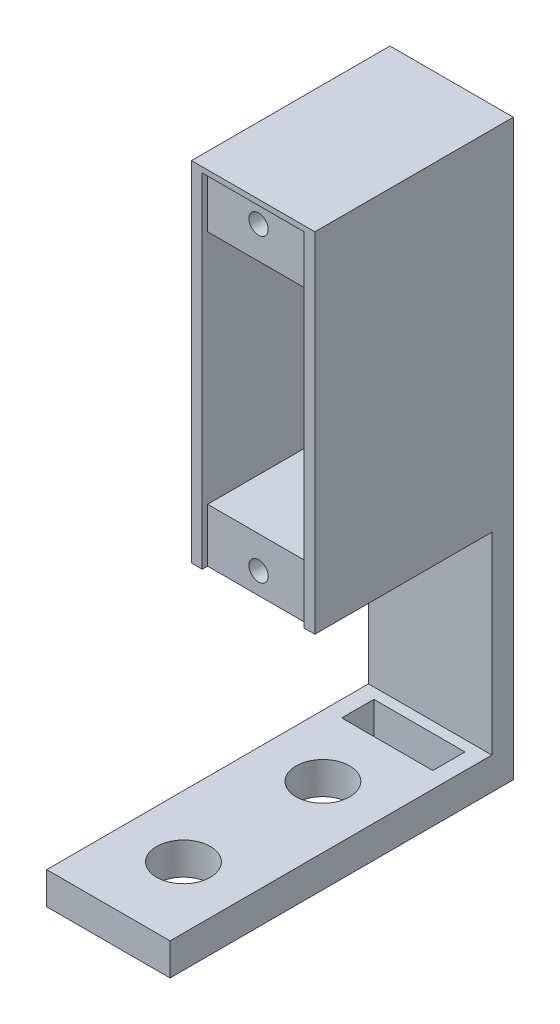
ISO-10303-21;
HEADER;
FILE_DESCRIPTION(('STEP AP214'),'2;1');
FILE_NAME('part.step','',(''),(''),'','','');
FILE_SCHEMA(('AUTOMOTIVE_DESIGN { 1 0 10303 214 1 1 1 1 }'));
ENDSEC;
DATA;
#1=APPLICATION_CONTEXT('core data for automotive mechanical design processes');
#2=APPLICATION_PROTOCOL_DEFINITION('international standard','automotive_design',2000,#1);
#3=PRODUCT_CONTEXT('',#1,'mechanical');
#4=PRODUCT('Part','Part','',(#3));
#5=PRODUCT_RELATED_PRODUCT_CATEGORY('part','',(#4));
#6=PRODUCT_DEFINITION_FORMATION('','',#4);
#7=PRODUCT_DEFINITION_CONTEXT('part definition',#1,'design');
#8=PRODUCT_DEFINITION('design','',#6,#7);
#9=PRODUCT_DEFINITION_SHAPE('','',#8);
#10=(LENGTH_UNIT() NAMED_UNIT(*) SI_UNIT(.MILLI.,.METRE.));
#11=(NAMED_UNIT(*) PLANE_ANGLE_UNIT() SI_UNIT($,.RADIAN.));
#12=(NAMED_UNIT(*) SI_UNIT($,.STERADIAN.) SOLID_ANGLE_UNIT());
#13=UNCERTAINTY_MEASURE_WITH_UNIT(LENGTH_MEASURE(1.E-05),#10,'distance_accuracy_value','');
#14=(GEOMETRIC_REPRESENTATION_CONTEXT(3) GLOBAL_UNCERTAINTY_ASSIGNED_CONTEXT((#13)) GLOBAL_UNIT_ASSIGNED_CONTEXT((#10,
#11,#12)) REPRESENTATION_CONTEXT('',''));
#15=CARTESIAN_POINT('',(0.,0.,0.));
#16=DIRECTION('',(0.,0.,1.));
#17=DIRECTION('',(1.,0.,0.));
#18=AXIS2_PLACEMENT_3D('',#15,#16,#17);
#19=CARTESIAN_POINT('',(0.,0.,2.));
#20=DIRECTION('',(0.,0.,1.));
#21=DIRECTION('',(1.,0.,0.));
#22=AXIS2_PLACEMENT_3D('',#19,#20,#21);
#23=PLANE('',#22);
#24=DIRECTION('',(0.,1.,0.));
#25=VECTOR('',#24,1.);
#26=CARTESIAN_POINT('',(-11.5,-21.,2.));
#27=LINE('',#26,#25);
#28=CARTESIAN_POINT('',(-11.5,-18.,2.));
#29=VERTEX_POINT('',#28);
#30=CARTESIAN_POINT('',(-11.5,0.,2.));
#31=VERTEX_POINT('',#30);
#32=EDGE_CURVE('E317',#29,#31,#27,.T.);
#33=ORIENTED_EDGE('',*,*,#32,.F.);
#34=DIRECTION('',(-1.,0.,0.));
#35=VECTOR('',#34,1.);
#36=CARTESIAN_POINT('',(0.,-18.,2.));
#37=LINE('',#36,#35);
#38=CARTESIAN_POINT('',(0.,-18.,2.));
#39=VERTEX_POINT('',#38);
#40=EDGE_CURVE('E238',#39,#29,#37,.T.);
#41=ORIENTED_EDGE('',*,*,#40,.F.);
#42=DIRECTION('',(0.,1.,0.));
#43=VECTOR('',#42,1.);
#44=CARTESIAN_POINT('',(0.,-21.,2.));
#45=LINE('',#44,#43);
#46=CARTESIAN_POINT('',(0.,0.,2.));
#47=VERTEX_POINT('',#46);
#48=EDGE_CURVE('E326',#39,#47,#45,.T.);
#49=ORIENTED_EDGE('',*,*,#48,.T.);
#50=DIRECTION('',(-1.,0.,0.));
#51=VECTOR('',#50,1.);
#52=CARTESIAN_POINT('',(0.,0.,2.));
#53=LINE('',#52,#51);
#54=CARTESIAN_POINT('',(-0.999999999999996,0.,2.));
#55=VERTEX_POINT('',#54);
#56=EDGE_CURVE('E318',#47,#55,#53,.T.);
#57=ORIENTED_EDGE('',*,*,#56,.T.);
#58=DIRECTION('',(0.,1.,0.));
#59=VECTOR('',#58,1.);
#60=CARTESIAN_POINT('',(-1.,32.,2.));
#61=LINE('',#60,#59);
#62=CARTESIAN_POINT('',(-0.999999999999997,27.,2.));
#63=VERTEX_POINT('',#62);
#64=EDGE_CURVE('E365',#55,#63,#61,.T.);
#65=ORIENTED_EDGE('',*,*,#64,.T.);
#66=DIRECTION('',(1.,0.,0.));
#67=VECTOR('',#66,1.);
#68=CARTESIAN_POINT('',(-10.5,27.,2.));
#69=LINE('',#68,#67);
#70=CARTESIAN_POINT('',(-10.5,27.,2.));
#71=VERTEX_POINT('',#70);
#72=EDGE_CURVE('E334',#71,#63,#69,.T.);
#73=ORIENTED_EDGE('',*,*,#72,.F.);
#74=DIRECTION('',(0.,-1.,0.));
#75=VECTOR('',#74,1.);
#76=CARTESIAN_POINT('',(-10.5,32.,2.));
#77=LINE('',#76,#75);
#78=CARTESIAN_POINT('',(-10.5,0.,2.));
#79=VERTEX_POINT('',#78);
#80=EDGE_CURVE('E362',#71,#79,#77,.T.);
#81=ORIENTED_EDGE('',*,*,#80,.T.);
#82=EDGE_CURVE('E323',#79,#31,#53,.T.);
#83=ORIENTED_EDGE('',*,*,#82,.T.);
#84=EDGE_LOOP('',(#33,#41,#49,#57,#65,#73,#81,#83));
#85=FACE_BOUND('',#84,.T.);
#86=ADVANCED_FACE('F39',(#85),#23,.T.);
#87=CARTESIAN_POINT('',(-10.5,32.,2.));
#88=DIRECTION('',(-1.,0.,0.));
#89=DIRECTION('',(0.,-1.,0.));
#90=AXIS2_PLACEMENT_3D('',#87,#88,#89);
#91=PLANE('',#90);
#92=DIRECTION('',(0.,0.,-1.));
#93=VECTOR('',#92,1.);
#94=CARTESIAN_POINT('',(-10.5,5.,18.));
#95=LINE('',#94,#93);
#96=CARTESIAN_POINT('',(-10.5,5.,18.));
#97=VERTEX_POINT('',#96);
#98=CARTESIAN_POINT('',(-10.5,5.,9.));
#99=VERTEX_POINT('',#98);
#100=EDGE_CURVE('E298',#97,#99,#95,.T.);
#101=ORIENTED_EDGE('',*,*,#100,.T.);
#102=DIRECTION('',(0.,-1.,0.));
#103=VECTOR('',#102,1.);
#104=CARTESIAN_POINT('',(-10.5,7.,9.));
#105=LINE('',#104,#103);
#106=CARTESIAN_POINT('',(-10.5,0.,9.));
#107=VERTEX_POINT('',#106);
#108=EDGE_CURVE('E272',#99,#107,#105,.T.);
#109=ORIENTED_EDGE('',*,*,#108,.T.);
#110=DIRECTION('',(0.,0.,-1.));
#111=VECTOR('',#110,1.);
#112=CARTESIAN_POINT('',(-10.5,0.,9.));
#113=LINE('',#112,#111);
#114=EDGE_CURVE('E259',#107,#79,#113,.T.);
#115=ORIENTED_EDGE('',*,*,#114,.T.);
#116=ORIENTED_EDGE('',*,*,#80,.F.);
#117=DIRECTION('',(0.,0.,-1.));
#118=VECTOR('',#117,1.);
#119=CARTESIAN_POINT('',(-10.5,27.,18.));
#120=LINE('',#119,#118);
#121=CARTESIAN_POINT('',(-10.5,27.,18.));
#122=VERTEX_POINT('',#121);
#123=EDGE_CURVE('E358',#122,#71,#120,.T.);
#124=ORIENTED_EDGE('',*,*,#123,.F.);
#125=DIRECTION('',(0.,-1.,0.));
#126=VECTOR('',#125,1.);
#127=CARTESIAN_POINT('',(-10.5,32.,18.));
#128=LINE('',#127,#126);
#129=CARTESIAN_POINT('',(-10.5,32.,18.));
#130=VERTEX_POINT('',#129);
#131=EDGE_CURVE('E338',#130,#122,#128,.T.);
#132=ORIENTED_EDGE('',*,*,#131,.F.);
#133=DIRECTION('',(0.,0.,1.));
#134=VECTOR('',#133,1.);
#135=CARTESIAN_POINT('',(-10.5,32.,2.));
#136=LINE('',#135,#134);
#137=CARTESIAN_POINT('',(-10.5,32.,18.5));
#138=VERTEX_POINT('',#137);
#139=EDGE_CURVE('E380',#130,#138,#136,.T.);
#140=ORIENTED_EDGE('',*,*,#139,.T.);
#141=DIRECTION('',(0.,-1.,0.));
#142=VECTOR('',#141,1.);
#143=CARTESIAN_POINT('',(-10.5,32.,18.5));
#144=LINE('',#143,#142);
#145=CARTESIAN_POINT('',(-10.5,0.,18.5));
#146=VERTEX_POINT('',#145);
#147=EDGE_CURVE('E361',#138,#146,#144,.T.);
#148=ORIENTED_EDGE('',*,*,#147,.T.);
#149=DIRECTION('',(0.,0.,1.));
#150=VECTOR('',#149,1.);
#151=CARTESIAN_POINT('',(-10.5,0.,2.));
#152=LINE('',#151,#150);
#153=CARTESIAN_POINT('',(-10.5,0.,18.));
#154=VERTEX_POINT('',#153);
#155=EDGE_CURVE('E369',#154,#146,#152,.T.);
#156=ORIENTED_EDGE('',*,*,#155,.F.);
#157=DIRECTION('',(0.,-1.,0.));
#158=VECTOR('',#157,1.);
#159=CARTESIAN_POINT('',(-10.5,0.,18.));
#160=LINE('',#159,#158);
#161=EDGE_CURVE('E292',#97,#154,#160,.T.);
#162=ORIENTED_EDGE('',*,*,#161,.F.);
#163=EDGE_LOOP('',(#101,#109,#115,#116,#124,#132,#140,#148,#156,#162));
#164=FACE_BOUND('',#163,.T.);
#165=ADVANCED_FACE('F467',(#164),#91,.F.);
#166=CARTESIAN_POINT('',(-1.,32.,2.));
#167=DIRECTION('',(1.,0.,0.));
#168=DIRECTION('',(0.,1.,0.));
#169=AXIS2_PLACEMENT_3D('',#166,#167,#168);
#170=PLANE('',#169);
#171=DIRECTION('',(0.,-1.,0.));
#172=VECTOR('',#171,1.);
#173=CARTESIAN_POINT('',(-0.999999999999998,7.,9.));
#174=LINE('',#173,#172);
#175=CARTESIAN_POINT('',(-0.999999999999998,5.,9.));
#176=VERTEX_POINT('',#175);
#177=CARTESIAN_POINT('',(-0.999999999999997,0.,9.));
#178=VERTEX_POINT('',#177);
#179=EDGE_CURVE('E271',#176,#178,#174,.T.);
#180=ORIENTED_EDGE('',*,*,#179,.F.);
#181=DIRECTION('',(0.,0.,-1.));
#182=VECTOR('',#181,1.);
#183=CARTESIAN_POINT('',(-0.999999999999997,5.,18.));
#184=LINE('',#183,#182);
#185=CARTESIAN_POINT('',(-0.999999999999997,5.,18.));
#186=VERTEX_POINT('',#185);
#187=EDGE_CURVE('E302',#186,#176,#184,.T.);
#188=ORIENTED_EDGE('',*,*,#187,.F.);
#189=DIRECTION('',(0.,1.,0.));
#190=VECTOR('',#189,1.);
#191=CARTESIAN_POINT('',(-0.999999999999997,0.,18.));
#192=LINE('',#191,#190);
#193=CARTESIAN_POINT('',(-0.999999999999997,0.,18.));
#194=VERTEX_POINT('',#193);
#195=EDGE_CURVE('E282',#194,#186,#192,.T.);
#196=ORIENTED_EDGE('',*,*,#195,.F.);
#197=DIRECTION('',(0.,0.,1.));
#198=VECTOR('',#197,1.);
#199=CARTESIAN_POINT('',(-0.999999999999997,0.,2.));
#200=LINE('',#199,#198);
#201=CARTESIAN_POINT('',(-0.999999999999997,0.,18.5));
#202=VERTEX_POINT('',#201);
#203=EDGE_CURVE('E387',#194,#202,#200,.T.);
#204=ORIENTED_EDGE('',*,*,#203,.T.);
#205=DIRECTION('',(0.,1.,0.));
#206=VECTOR('',#205,1.);
#207=CARTESIAN_POINT('',(-1.,32.,18.5));
#208=LINE('',#207,#206);
#209=CARTESIAN_POINT('',(-1.,32.,18.5));
#210=VERTEX_POINT('',#209);
#211=EDGE_CURVE('E373',#202,#210,#208,.T.);
#212=ORIENTED_EDGE('',*,*,#211,.T.);
#213=DIRECTION('',(0.,0.,1.));
#214=VECTOR('',#213,1.);
#215=CARTESIAN_POINT('',(-1.,32.,2.));
#216=LINE('',#215,#214);
#217=CARTESIAN_POINT('',(-1.,32.,18.));
#218=VERTEX_POINT('',#217);
#219=EDGE_CURVE('E384',#218,#210,#216,.T.);
#220=ORIENTED_EDGE('',*,*,#219,.F.);
#221=DIRECTION('',(0.,1.,0.));
#222=VECTOR('',#221,1.);
#223=CARTESIAN_POINT('',(-1.,32.,18.));
#224=LINE('',#223,#222);
#225=CARTESIAN_POINT('',(-0.999999999999997,27.,18.));
#226=VERTEX_POINT('',#225);
#227=EDGE_CURVE('E345',#226,#218,#224,.T.);
#228=ORIENTED_EDGE('',*,*,#227,.F.);
#229=DIRECTION('',(0.,0.,-1.));
#230=VECTOR('',#229,1.);
#231=CARTESIAN_POINT('',(-0.999999999999997,27.,18.));
#232=LINE('',#231,#230);
#233=EDGE_CURVE('E351',#226,#63,#232,.T.);
#234=ORIENTED_EDGE('',*,*,#233,.T.);
#235=ORIENTED_EDGE('',*,*,#64,.F.);
#236=DIRECTION('',(0.,0.,1.));
#237=VECTOR('',#236,1.);
#238=CARTESIAN_POINT('',(-0.999999999999997,0.,9.));
#239=LINE('',#238,#237);
#240=EDGE_CURVE('E263',#55,#178,#239,.T.);
#241=ORIENTED_EDGE('',*,*,#240,.T.);
#242=EDGE_LOOP('',(#180,#188,#196,#204,#212,#220,#228,#234,#235,#241));
#243=FACE_BOUND('',#242,.T.);
#244=ADVANCED_FACE('F473',(#243),#170,.F.);
#245=CARTESIAN_POINT('',(0.,0.,18.5));
#246=DIRECTION('',(0.,1.,0.));
#247=DIRECTION('',(-1.,0.,0.));
#248=AXIS2_PLACEMENT_3D('',#245,#246,#247);
#249=PLANE('',#248);
#250=ORIENTED_EDGE('',*,*,#82,.F.);
#251=ORIENTED_EDGE('',*,*,#114,.F.);
#252=DIRECTION('',(-1.,0.,0.));
#253=VECTOR('',#252,1.);
#254=CARTESIAN_POINT('',(-10.5,0.,9.));
#255=LINE('',#254,#253);
#256=EDGE_CURVE('E267',#178,#107,#255,.T.);
#257=ORIENTED_EDGE('',*,*,#256,.F.);
#258=ORIENTED_EDGE('',*,*,#240,.F.);
#259=ORIENTED_EDGE('',*,*,#56,.F.);
#260=DIRECTION('',(0.,0.,-1.));
#261=VECTOR('',#260,1.);
#262=CARTESIAN_POINT('',(0.,0.,18.5));
#263=LINE('',#262,#261);
#264=CARTESIAN_POINT('',(0.,0.,18.5));
#265=VERTEX_POINT('',#264);
#266=EDGE_CURVE('E408',#265,#47,#263,.T.);
#267=ORIENTED_EDGE('',*,*,#266,.F.);
#268=DIRECTION('',(1.,0.,0.));
#269=VECTOR('',#268,1.);
#270=CARTESIAN_POINT('',(0.,0.,18.5));
#271=LINE('',#270,#269);
#272=EDGE_CURVE('E403',#202,#265,#271,.T.);
#273=ORIENTED_EDGE('',*,*,#272,.F.);
#274=ORIENTED_EDGE('',*,*,#203,.F.);
#275=DIRECTION('',(1.,0.,0.));
#276=VECTOR('',#275,1.);
#277=CARTESIAN_POINT('',(-0.999999999999997,0.,18.));
#278=LINE('',#277,#276);
#279=EDGE_CURVE('E295',#154,#194,#278,.T.);
#280=ORIENTED_EDGE('',*,*,#279,.F.);
#281=ORIENTED_EDGE('',*,*,#155,.T.);
#282=CARTESIAN_POINT('',(-11.5,0.,18.5));
#283=VERTEX_POINT('',#282);
#284=EDGE_CURVE('E404',#283,#146,#271,.T.);
#285=ORIENTED_EDGE('',*,*,#284,.F.);
#286=DIRECTION('',(0.,0.,-1.));
#287=VECTOR('',#286,1.);
#288=CARTESIAN_POINT('',(-11.5,0.,18.5));
#289=LINE('',#288,#287);
#290=EDGE_CURVE('E420',#283,#31,#289,.T.);
#291=ORIENTED_EDGE('',*,*,#290,.T.);
#292=EDGE_LOOP('',(#250,#251,#257,#258,#259,#267,#273,#274,#280,#281,#285,#291));
#293=FACE_BOUND('',#292,.T.);
#294=ADVANCED_FACE('F487',(#293),#249,.F.);
#295=CARTESIAN_POINT('',(0.,0.,18.5));
#296=DIRECTION('',(-1.,0.,0.));
#297=DIRECTION('',(0.,-1.,0.));
#298=AXIS2_PLACEMENT_3D('',#295,#296,#297);
#299=PLANE('',#298);
#300=DIRECTION('',(0.,1.,0.));
#301=VECTOR('',#300,1.);
#302=CARTESIAN_POINT('',(0.,0.,0.));
#303=LINE('',#302,#301);
#304=CARTESIAN_POINT('',(0.,-21.,0.));
#305=VERTEX_POINT('',#304);
#306=CARTESIAN_POINT('',(0.,32.5,0.));
#307=VERTEX_POINT('',#306);
#308=EDGE_CURVE('E383',#305,#307,#303,.T.);
#309=ORIENTED_EDGE('',*,*,#308,.T.);
#310=DIRECTION('',(0.,0.,-1.));
#311=VECTOR('',#310,1.);
#312=CARTESIAN_POINT('',(0.,32.5,18.5));
#313=LINE('',#312,#311);
#314=CARTESIAN_POINT('',(0.,32.5,18.5));
#315=VERTEX_POINT('',#314);
#316=EDGE_CURVE('E428',#315,#307,#313,.T.);
#317=ORIENTED_EDGE('',*,*,#316,.F.);
#318=DIRECTION('',(0.,1.,0.));
#319=VECTOR('',#318,1.);
#320=CARTESIAN_POINT('',(0.,0.,18.5));
#321=LINE('',#320,#319);
#322=EDGE_CURVE('E392',#265,#315,#321,.T.);
#323=ORIENTED_EDGE('',*,*,#322,.F.);
#324=ORIENTED_EDGE('',*,*,#266,.T.);
#325=ORIENTED_EDGE('',*,*,#48,.F.);
#326=DIRECTION('',(0.,0.,-1.));
#327=VECTOR('',#326,1.);
#328=CARTESIAN_POINT('',(0.,-18.,32.));
#329=LINE('',#328,#327);
#330=CARTESIAN_POINT('',(0.,-18.,32.));
#331=VERTEX_POINT('',#330);
#332=EDGE_CURVE('E256',#331,#39,#329,.T.);
#333=ORIENTED_EDGE('',*,*,#332,.F.);
#334=DIRECTION('',(0.,1.,0.));
#335=VECTOR('',#334,1.);
#336=CARTESIAN_POINT('',(0.,-21.,32.));
#337=LINE('',#336,#335);
#338=CARTESIAN_POINT('',(0.,-21.,32.));
#339=VERTEX_POINT('',#338);
#340=EDGE_CURVE('E233',#339,#331,#337,.T.);
#341=ORIENTED_EDGE('',*,*,#340,.F.);
#342=DIRECTION('',(0.,0.,1.));
#343=VECTOR('',#342,1.);
#344=CARTESIAN_POINT('',(0.,-21.,0.));
#345=LINE('',#344,#343);
#346=EDGE_CURVE('E306',#305,#339,#345,.T.);
#347=ORIENTED_EDGE('',*,*,#346,.F.);
#348=EDGE_LOOP('',(#309,#317,#323,#324,#325,#333,#341,#347));
#349=FACE_BOUND('',#348,.T.);
#350=ADVANCED_FACE('F41',(#349),#299,.F.);
#351=CARTESIAN_POINT('',(0.,32.5,18.5));
#352=DIRECTION('',(0.,-1.,0.));
#353=DIRECTION('',(0.,0.,-1.));
#354=AXIS2_PLACEMENT_3D('',#351,#352,#353);
#355=PLANE('',#354);
#356=DIRECTION('',(-1.,0.,0.));
#357=VECTOR('',#356,1.);
#358=CARTESIAN_POINT('',(0.,32.5,0.));
#359=LINE('',#358,#357);
#360=CARTESIAN_POINT('',(-11.5,32.5,0.));
#361=VERTEX_POINT('',#360);
#362=EDGE_CURVE('E412',#307,#361,#359,.T.);
#363=ORIENTED_EDGE('',*,*,#362,.T.);
#364=DIRECTION('',(0.,0.,-1.));
#365=VECTOR('',#364,1.);
#366=CARTESIAN_POINT('',(-11.5,32.5,18.5));
#367=LINE('',#366,#365);
#368=CARTESIAN_POINT('',(-11.5,32.5,18.5));
#369=VERTEX_POINT('',#368);
#370=EDGE_CURVE('E424',#369,#361,#367,.T.);
#371=ORIENTED_EDGE('',*,*,#370,.F.);
#372=DIRECTION('',(-1.,0.,0.));
#373=VECTOR('',#372,1.);
#374=CARTESIAN_POINT('',(0.,32.5,18.5));
#375=LINE('',#374,#373);
#376=EDGE_CURVE('E396',#315,#369,#375,.T.);
#377=ORIENTED_EDGE('',*,*,#376,.F.);
#378=ORIENTED_EDGE('',*,*,#316,.T.);
#379=EDGE_LOOP('',(#363,#371,#377,#378));
#380=FACE_BOUND('',#379,.T.);
#381=ADVANCED_FACE('F502',(#380),#355,.F.);
#382=CARTESIAN_POINT('',(-11.5,0.,18.5));
#383=DIRECTION('',(1.,0.,0.));
#384=DIRECTION('',(0.,0.,-1.));
#385=AXIS2_PLACEMENT_3D('',#382,#383,#384);
#386=PLANE('',#385);
#387=DIRECTION('',(0.,-1.,0.));
#388=VECTOR('',#387,1.);
#389=CARTESIAN_POINT('',(-11.5,0.,0.));
#390=LINE('',#389,#388);
#391=CARTESIAN_POINT('',(-11.5,-21.,0.));
#392=VERTEX_POINT('',#391);
#393=EDGE_CURVE('E397',#361,#392,#390,.T.);
#394=ORIENTED_EDGE('',*,*,#393,.T.);
#395=DIRECTION('',(0.,0.,-1.));
#396=VECTOR('',#395,1.);
#397=CARTESIAN_POINT('',(-11.5,-21.,0.));
#398=LINE('',#397,#396);
#399=CARTESIAN_POINT('',(-11.5,-21.,32.));
#400=VERTEX_POINT('',#399);
#401=EDGE_CURVE('E309',#400,#392,#398,.T.);
#402=ORIENTED_EDGE('',*,*,#401,.F.);
#403=DIRECTION('',(0.,-1.,0.));
#404=VECTOR('',#403,1.);
#405=CARTESIAN_POINT('',(-11.5,-21.,32.));
#406=LINE('',#405,#404);
#407=CARTESIAN_POINT('',(-11.5,-18.,32.));
#408=VERTEX_POINT('',#407);
#409=EDGE_CURVE('E241',#408,#400,#406,.T.);
#410=ORIENTED_EDGE('',*,*,#409,.F.);
#411=DIRECTION('',(0.,0.,-1.));
#412=VECTOR('',#411,1.);
#413=CARTESIAN_POINT('',(-11.5,-18.,32.));
#414=LINE('',#413,#412);
#415=EDGE_CURVE('E249',#408,#29,#414,.T.);
#416=ORIENTED_EDGE('',*,*,#415,.T.);
#417=ORIENTED_EDGE('',*,*,#32,.T.);
#418=ORIENTED_EDGE('',*,*,#290,.F.);
#419=DIRECTION('',(0.,-1.,0.));
#420=VECTOR('',#419,1.);
#421=CARTESIAN_POINT('',(-11.5,0.,18.5));
#422=LINE('',#421,#420);
#423=EDGE_CURVE('E400',#369,#283,#422,.T.);
#424=ORIENTED_EDGE('',*,*,#423,.F.);
#425=ORIENTED_EDGE('',*,*,#370,.T.);
#426=EDGE_LOOP('',(#394,#402,#410,#416,#417,#418,#424,#425));
#427=FACE_BOUND('',#426,.T.);
#428=ADVANCED_FACE('F493',(#427),#386,.F.);
#429=CARTESIAN_POINT('',(0.,0.,18.5));
#430=DIRECTION('',(0.,0.,1.));
#431=DIRECTION('',(1.,0.,0.));
#432=AXIS2_PLACEMENT_3D('',#429,#430,#431);
#433=PLANE('',#432);
#434=ORIENTED_EDGE('',*,*,#147,.F.);
#435=DIRECTION('',(-1.,0.,0.));
#436=VECTOR('',#435,1.);
#437=CARTESIAN_POINT('',(-10.5,32.,18.5));
#438=LINE('',#437,#436);
#439=EDGE_CURVE('E366',#210,#138,#438,.T.);
#440=ORIENTED_EDGE('',*,*,#439,.F.);
#441=ORIENTED_EDGE('',*,*,#211,.F.);
#442=ORIENTED_EDGE('',*,*,#272,.T.);
#443=ORIENTED_EDGE('',*,*,#322,.T.);
#444=ORIENTED_EDGE('',*,*,#376,.T.);
#445=ORIENTED_EDGE('',*,*,#423,.T.);
#446=ORIENTED_EDGE('',*,*,#284,.T.);
#447=EDGE_LOOP('',(#434,#440,#441,#442,#443,#444,#445,#446));
#448=FACE_BOUND('',#447,.T.);
#449=ADVANCED_FACE('F490',(#448),#433,.T.);
#450=CARTESIAN_POINT('',(0.,0.,0.));
#451=DIRECTION('',(0.,0.,1.));
#452=DIRECTION('',(1.,0.,0.));
#453=AXIS2_PLACEMENT_3D('',#450,#451,#452);
#454=PLANE('',#453);
#455=ORIENTED_EDGE('',*,*,#308,.F.);
#456=DIRECTION('',(1.,0.,0.));
#457=VECTOR('',#456,1.);
#458=CARTESIAN_POINT('',(0.,-21.,0.));
#459=LINE('',#458,#457);
#460=EDGE_CURVE('E313',#392,#305,#459,.T.);
#461=ORIENTED_EDGE('',*,*,#460,.F.);
#462=ORIENTED_EDGE('',*,*,#393,.F.);
#463=ORIENTED_EDGE('',*,*,#362,.F.);
#464=EDGE_LOOP('',(#455,#461,#462,#463));
#465=FACE_BOUND('',#464,.T.);
#466=ADVANCED_FACE('F484',(#465),#454,.F.);
#467=CARTESIAN_POINT('',(-10.5,32.,2.));
#468=DIRECTION('',(0.,1.,0.));
#469=DIRECTION('',(0.,0.,1.));
#470=AXIS2_PLACEMENT_3D('',#467,#468,#469);
#471=PLANE('',#470);
#472=ORIENTED_EDGE('',*,*,#139,.F.);
#473=DIRECTION('',(-1.,0.,0.));
#474=VECTOR('',#473,1.);
#475=CARTESIAN_POINT('',(-10.5,32.,18.));
#476=LINE('',#475,#474);
#477=EDGE_CURVE('E348',#218,#130,#476,.T.);
#478=ORIENTED_EDGE('',*,*,#477,.F.);
#479=ORIENTED_EDGE('',*,*,#219,.T.);
#480=ORIENTED_EDGE('',*,*,#439,.T.);
#481=EDGE_LOOP('',(#472,#478,#479,#480));
#482=FACE_BOUND('',#481,.T.);
#483=ADVANCED_FACE('F481',(#482),#471,.F.);
#484=CARTESIAN_POINT('',(-10.5,27.,18.));
#485=DIRECTION('',(0.,1.,0.));
#486=DIRECTION('',(0.,0.,1.));
#487=AXIS2_PLACEMENT_3D('',#484,#485,#486);
#488=PLANE('',#487);
#489=ORIENTED_EDGE('',*,*,#72,.T.);
#490=ORIENTED_EDGE('',*,*,#233,.F.);
#491=DIRECTION('',(1.,0.,0.));
#492=VECTOR('',#491,1.);
#493=CARTESIAN_POINT('',(-10.5,27.,18.));
#494=LINE('',#493,#492);
#495=EDGE_CURVE('E342',#122,#226,#494,.T.);
#496=ORIENTED_EDGE('',*,*,#495,.F.);
#497=ORIENTED_EDGE('',*,*,#123,.T.);
#498=EDGE_LOOP('',(#489,#490,#496,#497));
#499=FACE_BOUND('',#498,.T.);
#500=ADVANCED_FACE('F479',(#499),#488,.F.);
#501=CARTESIAN_POINT('',(0.,0.,18.));
#502=DIRECTION('',(0.,0.,1.));
#503=DIRECTION('',(1.,0.,0.));
#504=AXIS2_PLACEMENT_3D('',#501,#502,#503);
#505=PLANE('',#504);
#506=CARTESIAN_POINT('',(-5.75,30.,18.));
#507=DIRECTION('',(0.,0.,1.));
#508=DIRECTION('',(1.,0.,0.));
#509=AXIS2_PLACEMENT_3D('',#506,#507,#508);
#510=CIRCLE('',#509,0.9);
#511=CARTESIAN_POINT('',(-4.85,30.,18.));
#512=VERTEX_POINT('',#511);
#513=EDGE_CURVE('E329',#512,#512,#510,.T.);
#514=ORIENTED_EDGE('',*,*,#513,.F.);
#515=EDGE_LOOP('',(#514));
#516=FACE_BOUND('',#515,.T.);
#517=ORIENTED_EDGE('',*,*,#131,.T.);
#518=ORIENTED_EDGE('',*,*,#495,.T.);
#519=ORIENTED_EDGE('',*,*,#227,.T.);
#520=ORIENTED_EDGE('',*,*,#477,.T.);
#521=EDGE_LOOP('',(#517,#518,#519,#520));
#522=FACE_BOUND('',#521,.T.);
#523=ADVANCED_FACE('F555',(#516,#522),#505,.T.);
#524=CARTESIAN_POINT('',(-5.75,30.,12.));
#525=DIRECTION('',(0.,0.,1.));
#526=DIRECTION('',(1.,0.,0.));
#527=AXIS2_PLACEMENT_3D('',#524,#525,#526);
#528=CYLINDRICAL_SURFACE('',#527,0.9);
#529=CARTESIAN_POINT('',(-5.75,30.,12.));
#530=DIRECTION('',(0.,0.,1.));
#531=DIRECTION('',(1.,0.,0.));
#532=AXIS2_PLACEMENT_3D('',#529,#530,#531);
#533=CIRCLE('',#532,0.9);
#534=CARTESIAN_POINT('',(-4.85,30.,12.));
#535=VERTEX_POINT('',#534);
#536=EDGE_CURVE('E330',#535,#535,#533,.T.);
#537=ORIENTED_EDGE('',*,*,#536,.F.);
#538=EDGE_LOOP('',(#537));
#539=FACE_BOUND('',#538,.T.);
#540=ORIENTED_EDGE('',*,*,#513,.T.);
#541=EDGE_LOOP('',(#540));
#542=FACE_BOUND('',#541,.T.);
#543=ADVANCED_FACE('F588',(#539,#542),#528,.F.);
#544=CARTESIAN_POINT('',(-5.75,30.,12.));
#545=DIRECTION('',(0.,0.,1.));
#546=DIRECTION('',(1.,0.,0.));
#547=AXIS2_PLACEMENT_3D('',#544,#545,#546);
#548=PLANE('',#547);
#549=ORIENTED_EDGE('',*,*,#536,.T.);
#550=EDGE_LOOP('',(#549));
#551=FACE_BOUND('',#550,.T.);
#552=ADVANCED_FACE('F585',(#551),#548,.T.);
#553=CARTESIAN_POINT('',(0.,-21.,0.));
#554=DIRECTION('',(0.,-1.,0.));
#555=DIRECTION('',(1.,0.,0.));
#556=AXIS2_PLACEMENT_3D('',#553,#554,#555);
#557=PLANE('',#556);
#558=DIRECTION('',(0.,0.,-1.));
#559=VECTOR('',#558,1.);
#560=CARTESIAN_POINT('',(-10.,-21.,6.));
#561=LINE('',#560,#559);
#562=CARTESIAN_POINT('',(-10.,-21.,6.));
#563=VERTEX_POINT('',#562);
#564=CARTESIAN_POINT('',(-10.,-21.,3.));
#565=VERTEX_POINT('',#564);
#566=EDGE_CURVE('E55',#563,#565,#561,.T.);
#567=ORIENTED_EDGE('',*,*,#566,.F.);
#568=DIRECTION('',(-1.,0.,0.));
#569=VECTOR('',#568,1.);
#570=CARTESIAN_POINT('',(-10.,-21.,6.));
#571=LINE('',#570,#569);
#572=CARTESIAN_POINT('',(-1.5,-21.,6.));
#573=VERTEX_POINT('',#572);
#574=EDGE_CURVE('E210',#573,#563,#571,.T.);
#575=ORIENTED_EDGE('',*,*,#574,.F.);
#576=DIRECTION('',(0.,0.,1.));
#577=VECTOR('',#576,1.);
#578=CARTESIAN_POINT('',(-1.5,-21.,6.));
#579=LINE('',#578,#577);
#580=CARTESIAN_POINT('',(-1.5,-21.,3.));
#581=VERTEX_POINT('',#580);
#582=EDGE_CURVE('E192',#581,#573,#579,.T.);
#583=ORIENTED_EDGE('',*,*,#582,.F.);
#584=DIRECTION('',(1.,0.,0.));
#585=VECTOR('',#584,1.);
#586=CARTESIAN_POINT('',(-10.,-21.,3.));
#587=LINE('',#586,#585);
#588=EDGE_CURVE('E202',#565,#581,#587,.T.);
#589=ORIENTED_EDGE('',*,*,#588,.F.);
#590=EDGE_LOOP('',(#567,#575,#583,#589));
#591=FACE_BOUND('',#590,.T.);
#592=CARTESIAN_POINT('',(-5.75,-21.,12.));
#593=DIRECTION('',(0.,-1.,0.));
#594=DIRECTION('',(1.,0.,0.));
#595=AXIS2_PLACEMENT_3D('',#592,#593,#594);
#596=CIRCLE('',#595,2.5);
#597=CARTESIAN_POINT('',(-3.25,-21.,12.));
#598=VERTEX_POINT('',#597);
#599=EDGE_CURVE('E225',#598,#598,#596,.T.);
#600=ORIENTED_EDGE('',*,*,#599,.F.);
#601=EDGE_LOOP('',(#600));
#602=FACE_BOUND('',#601,.T.);
#603=CARTESIAN_POINT('',(-5.75,-21.,25.));
#604=DIRECTION('',(0.,-1.,0.));
#605=DIRECTION('',(1.,0.,0.));
#606=AXIS2_PLACEMENT_3D('',#603,#604,#605);
#607=CIRCLE('',#606,2.5);
#608=CARTESIAN_POINT('',(-3.25,-21.,25.));
#609=VERTEX_POINT('',#608);
#610=EDGE_CURVE('E220',#609,#609,#607,.T.);
#611=ORIENTED_EDGE('',*,*,#610,.F.);
#612=EDGE_LOOP('',(#611));
#613=FACE_BOUND('',#612,.T.);
#614=ORIENTED_EDGE('',*,*,#346,.T.);
#615=DIRECTION('',(1.,0.,0.));
#616=VECTOR('',#615,1.);
#617=CARTESIAN_POINT('',(0.,-21.,32.));
#618=LINE('',#617,#616);
#619=EDGE_CURVE('E245',#400,#339,#618,.T.);
#620=ORIENTED_EDGE('',*,*,#619,.F.);
#621=ORIENTED_EDGE('',*,*,#401,.T.);
#622=ORIENTED_EDGE('',*,*,#460,.T.);
#623=EDGE_LOOP('',(#614,#620,#621,#622));
#624=FACE_BOUND('',#623,.T.);
#625=ADVANCED_FACE('F207',(#591,#602,#613,#624),#557,.T.);
#626=CARTESIAN_POINT('',(-0.999999999999997,5.,18.));
#627=DIRECTION('',(0.,-1.,0.));
#628=DIRECTION('',(1.,0.,0.));
#629=AXIS2_PLACEMENT_3D('',#626,#627,#628);
#630=PLANE('',#629);
#631=ORIENTED_EDGE('',*,*,#187,.T.);
#632=DIRECTION('',(-1.,0.,0.));
#633=VECTOR('',#632,1.);
#634=CARTESIAN_POINT('',(-0.999999999999997,5.,9.));
#635=LINE('',#634,#633);
#636=EDGE_CURVE('E322',#176,#99,#635,.T.);
#637=ORIENTED_EDGE('',*,*,#636,.T.);
#638=ORIENTED_EDGE('',*,*,#100,.F.);
#639=DIRECTION('',(-1.,0.,0.));
#640=VECTOR('',#639,1.);
#641=CARTESIAN_POINT('',(-0.999999999999997,5.,18.));
#642=LINE('',#641,#640);
#643=EDGE_CURVE('E289',#186,#97,#642,.T.);
#644=ORIENTED_EDGE('',*,*,#643,.F.);
#645=EDGE_LOOP('',(#631,#637,#638,#644));
#646=FACE_BOUND('',#645,.T.);
#647=ADVANCED_FACE('F563',(#646),#630,.F.);
#648=CARTESIAN_POINT('',(0.,0.,18.));
#649=DIRECTION('',(0.,0.,1.));
#650=DIRECTION('',(1.,0.,0.));
#651=AXIS2_PLACEMENT_3D('',#648,#649,#650);
#652=PLANE('',#651);
#653=CARTESIAN_POINT('',(-5.75,2.,18.));
#654=DIRECTION('',(0.,0.,1.));
#655=DIRECTION('',(1.,0.,0.));
#656=AXIS2_PLACEMENT_3D('',#653,#654,#655);
#657=CIRCLE('',#656,0.9);
#658=CARTESIAN_POINT('',(-4.85,2.,18.));
#659=VERTEX_POINT('',#658);
#660=EDGE_CURVE('E275',#659,#659,#657,.T.);
#661=ORIENTED_EDGE('',*,*,#660,.F.);
#662=EDGE_LOOP('',(#661));
#663=FACE_BOUND('',#662,.T.);
#664=ORIENTED_EDGE('',*,*,#195,.T.);
#665=ORIENTED_EDGE('',*,*,#643,.T.);
#666=ORIENTED_EDGE('',*,*,#161,.T.);
#667=ORIENTED_EDGE('',*,*,#279,.T.);
#668=EDGE_LOOP('',(#664,#665,#666,#667));
#669=FACE_BOUND('',#668,.T.);
#670=ADVANCED_FACE('F567',(#663,#669),#652,.T.);
#671=CARTESIAN_POINT('',(-5.75,2.,11.));
#672=DIRECTION('',(0.,0.,1.));
#673=DIRECTION('',(1.,0.,0.));
#674=AXIS2_PLACEMENT_3D('',#671,#672,#673);
#675=CYLINDRICAL_SURFACE('',#674,0.9);
#676=CARTESIAN_POINT('',(-5.75,2.,11.));
#677=DIRECTION('',(0.,0.,1.));
#678=DIRECTION('',(1.,0.,0.));
#679=AXIS2_PLACEMENT_3D('',#676,#677,#678);
#680=CIRCLE('',#679,0.9);
#681=CARTESIAN_POINT('',(-4.85,2.,11.));
#682=VERTEX_POINT('',#681);
#683=EDGE_CURVE('E278',#682,#682,#680,.T.);
#684=ORIENTED_EDGE('',*,*,#683,.F.);
#685=EDGE_LOOP('',(#684));
#686=FACE_BOUND('',#685,.T.);
#687=ORIENTED_EDGE('',*,*,#660,.T.);
#688=EDGE_LOOP('',(#687));
#689=FACE_BOUND('',#688,.T.);
#690=ADVANCED_FACE('F569',(#686,#689),#675,.F.);
#691=CARTESIAN_POINT('',(-5.75,2.,11.));
#692=DIRECTION('',(0.,0.,1.));
#693=DIRECTION('',(1.,0.,0.));
#694=AXIS2_PLACEMENT_3D('',#691,#692,#693);
#695=PLANE('',#694);
#696=ORIENTED_EDGE('',*,*,#683,.T.);
#697=EDGE_LOOP('',(#696));
#698=FACE_BOUND('',#697,.T.);
#699=ADVANCED_FACE('F576',(#698),#695,.T.);
#700=CARTESIAN_POINT('',(-10.5,7.,9.));
#701=DIRECTION('',(0.,0.,1.));
#702=DIRECTION('',(1.,0.,0.));
#703=AXIS2_PLACEMENT_3D('',#700,#701,#702);
#704=PLANE('',#703);
#705=ORIENTED_EDGE('',*,*,#179,.T.);
#706=ORIENTED_EDGE('',*,*,#256,.T.);
#707=ORIENTED_EDGE('',*,*,#108,.F.);
#708=ORIENTED_EDGE('',*,*,#636,.F.);
#709=EDGE_LOOP('',(#705,#706,#707,#708));
#710=FACE_BOUND('',#709,.T.);
#711=ADVANCED_FACE('F559',(#710),#704,.F.);
#712=CARTESIAN_POINT('',(0.,-18.,32.));
#713=DIRECTION('',(0.,-1.,0.));
#714=DIRECTION('',(0.,0.,-1.));
#715=AXIS2_PLACEMENT_3D('',#712,#713,#714);
#716=PLANE('',#715);
#717=DIRECTION('',(-1.,0.,0.));
#718=VECTOR('',#717,1.);
#719=CARTESIAN_POINT('',(0.,-18.,6.00000000000001));
#720=LINE('',#719,#718);
#721=CARTESIAN_POINT('',(-1.5,-18.,6.));
#722=VERTEX_POINT('',#721);
#723=CARTESIAN_POINT('',(-10.,-18.,6.));
#724=VERTEX_POINT('',#723);
#725=EDGE_CURVE('E48',#722,#724,#720,.T.);
#726=ORIENTED_EDGE('',*,*,#725,.T.);
#727=DIRECTION('',(0.,0.,-1.));
#728=VECTOR('',#727,1.);
#729=CARTESIAN_POINT('',(-10.,-18.,32.));
#730=LINE('',#729,#728);
#731=CARTESIAN_POINT('',(-10.,-18.,3.));
#732=VERTEX_POINT('',#731);
#733=EDGE_CURVE('E11',#724,#732,#730,.T.);
#734=ORIENTED_EDGE('',*,*,#733,.T.);
#735=DIRECTION('',(1.,0.,0.));
#736=VECTOR('',#735,1.);
#737=CARTESIAN_POINT('',(0.,-18.,3.));
#738=LINE('',#737,#736);
#739=CARTESIAN_POINT('',(-1.5,-18.,3.));
#740=VERTEX_POINT('',#739);
#741=EDGE_CURVE('E435',#732,#740,#738,.T.);
#742=ORIENTED_EDGE('',*,*,#741,.T.);
#743=DIRECTION('',(0.,0.,1.));
#744=VECTOR('',#743,1.);
#745=CARTESIAN_POINT('',(-1.50000000000001,-18.,32.));
#746=LINE('',#745,#744);
#747=EDGE_CURVE('E195',#740,#722,#746,.T.);
#748=ORIENTED_EDGE('',*,*,#747,.T.);
#749=EDGE_LOOP('',(#726,#734,#742,#748));
#750=FACE_BOUND('',#749,.T.);
#751=CARTESIAN_POINT('',(-5.75,-18.,12.));
#752=DIRECTION('',(0.,-1.,0.));
#753=DIRECTION('',(0.,0.,-1.));
#754=AXIS2_PLACEMENT_3D('',#751,#752,#753);
#755=CIRCLE('',#754,2.5);
#756=CARTESIAN_POINT('',(-5.75,-18.,9.5));
#757=VERTEX_POINT('',#756);
#758=EDGE_CURVE('E252',#757,#757,#755,.T.);
#759=ORIENTED_EDGE('',*,*,#758,.T.);
#760=EDGE_LOOP('',(#759));
#761=FACE_BOUND('',#760,.T.);
#762=CARTESIAN_POINT('',(-5.75,-18.,25.));
#763=DIRECTION('',(0.,-1.,0.));
#764=DIRECTION('',(0.,0.,-1.));
#765=AXIS2_PLACEMENT_3D('',#762,#763,#764);
#766=CIRCLE('',#765,2.5);
#767=CARTESIAN_POINT('',(-5.75,-18.,22.5));
#768=VERTEX_POINT('',#767);
#769=EDGE_CURVE('E229',#768,#768,#766,.T.);
#770=ORIENTED_EDGE('',*,*,#769,.T.);
#771=EDGE_LOOP('',(#770));
#772=FACE_BOUND('',#771,.T.);
#773=ORIENTED_EDGE('',*,*,#40,.T.);
#774=ORIENTED_EDGE('',*,*,#415,.F.);
#775=DIRECTION('',(-1.,0.,0.));
#776=VECTOR('',#775,1.);
#777=CARTESIAN_POINT('',(0.,-18.,32.));
#778=LINE('',#777,#776);
#779=EDGE_CURVE('E237',#331,#408,#778,.T.);
#780=ORIENTED_EDGE('',*,*,#779,.F.);
#781=ORIENTED_EDGE('',*,*,#332,.T.);
#782=EDGE_LOOP('',(#773,#774,#780,#781));
#783=FACE_BOUND('',#782,.T.);
#784=ADVANCED_FACE('F448',(#750,#761,#772,#783),#716,.F.);
#785=CARTESIAN_POINT('',(0.,0.,32.));
#786=DIRECTION('',(0.,0.,1.));
#787=DIRECTION('',(1.,0.,0.));
#788=AXIS2_PLACEMENT_3D('',#785,#786,#787);
#789=PLANE('',#788);
#790=ORIENTED_EDGE('',*,*,#340,.T.);
#791=ORIENTED_EDGE('',*,*,#779,.T.);
#792=ORIENTED_EDGE('',*,*,#409,.T.);
#793=ORIENTED_EDGE('',*,*,#619,.T.);
#794=EDGE_LOOP('',(#790,#791,#792,#793));
#795=FACE_BOUND('',#794,.T.);
#796=ADVANCED_FACE('F523',(#795),#789,.T.);
#797=CARTESIAN_POINT('',(-5.75,-11.,25.));
#798=DIRECTION('',(0.,-1.,0.));
#799=DIRECTION('',(1.,0.,0.));
#800=AXIS2_PLACEMENT_3D('',#797,#798,#799);
#801=CYLINDRICAL_SURFACE('',#800,2.5);
#802=ORIENTED_EDGE('',*,*,#610,.T.);
#803=EDGE_LOOP('',(#802));
#804=FACE_BOUND('',#803,.T.);
#805=ORIENTED_EDGE('',*,*,#769,.F.);
#806=EDGE_LOOP('',(#805));
#807=FACE_BOUND('',#806,.T.);
#808=ADVANCED_FACE('F462',(#804,#807),#801,.F.);
#809=CARTESIAN_POINT('',(-5.75,-11.,12.));
#810=DIRECTION('',(0.,-1.,0.));
#811=DIRECTION('',(1.,0.,0.));
#812=AXIS2_PLACEMENT_3D('',#809,#810,#811);
#813=CYLINDRICAL_SURFACE('',#812,2.5);
#814=ORIENTED_EDGE('',*,*,#599,.T.);
#815=EDGE_LOOP('',(#814));
#816=FACE_BOUND('',#815,.T.);
#817=ORIENTED_EDGE('',*,*,#758,.F.);
#818=EDGE_LOOP('',(#817));
#819=FACE_BOUND('',#818,.T.);
#820=ADVANCED_FACE('F455',(#816,#819),#813,.F.);
#821=CARTESIAN_POINT('',(-10.,-11.,6.));
#822=DIRECTION('',(-1.,0.,0.));
#823=DIRECTION('',(0.,0.,1.));
#824=AXIS2_PLACEMENT_3D('',#821,#822,#823);
#825=PLANE('',#824);
#826=DIRECTION('',(0.,-1.,0.));
#827=VECTOR('',#826,1.);
#828=CARTESIAN_POINT('',(-10.,-11.,6.));
#829=LINE('',#828,#827);
#830=EDGE_CURVE('E217',#724,#563,#829,.T.);
#831=ORIENTED_EDGE('',*,*,#830,.T.);
#832=ORIENTED_EDGE('',*,*,#566,.T.);
#833=DIRECTION('',(0.,-1.,0.));
#834=VECTOR('',#833,1.);
#835=CARTESIAN_POINT('',(-10.,-11.,3.));
#836=LINE('',#835,#834);
#837=EDGE_CURVE('E199',#732,#565,#836,.T.);
#838=ORIENTED_EDGE('',*,*,#837,.F.);
#839=ORIENTED_EDGE('',*,*,#733,.F.);
#840=EDGE_LOOP('',(#831,#832,#838,#839));
#841=FACE_BOUND('',#840,.T.);
#842=ADVANCED_FACE('F453',(#841),#825,.F.);
#843=CARTESIAN_POINT('',(-10.,-11.,6.));
#844=DIRECTION('',(0.,0.,1.));
#845=DIRECTION('',(1.,0.,0.));
#846=AXIS2_PLACEMENT_3D('',#843,#844,#845);
#847=PLANE('',#846);
#848=DIRECTION('',(0.,-1.,0.));
#849=VECTOR('',#848,1.);
#850=CARTESIAN_POINT('',(-1.5,-11.,6.));
#851=LINE('',#850,#849);
#852=EDGE_CURVE('E198',#722,#573,#851,.T.);
#853=ORIENTED_EDGE('',*,*,#852,.T.);
#854=ORIENTED_EDGE('',*,*,#574,.T.);
#855=ORIENTED_EDGE('',*,*,#830,.F.);
#856=ORIENTED_EDGE('',*,*,#725,.F.);
#857=EDGE_LOOP('',(#853,#854,#855,#856));
#858=FACE_BOUND('',#857,.T.);
#859=ADVANCED_FACE('F452',(#858),#847,.F.);
#860=CARTESIAN_POINT('',(-1.5,-11.,6.));
#861=DIRECTION('',(1.,0.,0.));
#862=DIRECTION('',(0.,0.,-1.));
#863=AXIS2_PLACEMENT_3D('',#860,#861,#862);
#864=PLANE('',#863);
#865=DIRECTION('',(0.,-1.,0.));
#866=VECTOR('',#865,1.);
#867=CARTESIAN_POINT('',(-1.5,-11.,3.));
#868=LINE('',#867,#866);
#869=EDGE_CURVE('E63',#740,#581,#868,.T.);
#870=ORIENTED_EDGE('',*,*,#869,.T.);
#871=ORIENTED_EDGE('',*,*,#582,.T.);
#872=ORIENTED_EDGE('',*,*,#852,.F.);
#873=ORIENTED_EDGE('',*,*,#747,.F.);
#874=EDGE_LOOP('',(#870,#871,#872,#873));
#875=FACE_BOUND('',#874,.T.);
#876=ADVANCED_FACE('F189',(#875),#864,.F.);
#877=CARTESIAN_POINT('',(-10.,-11.,3.));
#878=DIRECTION('',(0.,0.,-1.));
#879=DIRECTION('',(-1.,0.,0.));
#880=AXIS2_PLACEMENT_3D('',#877,#878,#879);
#881=PLANE('',#880);
#882=ORIENTED_EDGE('',*,*,#837,.T.);
#883=ORIENTED_EDGE('',*,*,#588,.T.);
#884=ORIENTED_EDGE('',*,*,#869,.F.);
#885=ORIENTED_EDGE('',*,*,#741,.F.);
#886=EDGE_LOOP('',(#882,#883,#884,#885));
#887=FACE_BOUND('',#886,.T.);
#888=ADVANCED_FACE('F203',(#887),#881,.F.);
#889=CLOSED_SHELL('',(#86,#165,#244,#294,#350,#381,#428,#449,#466,#483,#500,#523,#543,#552,#625,
#647,#670,#690,#699,#711,#784,#796,#808,#820,#842,#859,#876,#888));
#890=MANIFOLD_SOLID_BREP('B2',#889);
#891=ADVANCED_BREP_SHAPE_REPRESENTATION('',(#18,#890),#14);
#892=SHAPE_DEFINITION_REPRESENTATION(#9,#891);
ENDSEC;
END-ISO-10303-21;
